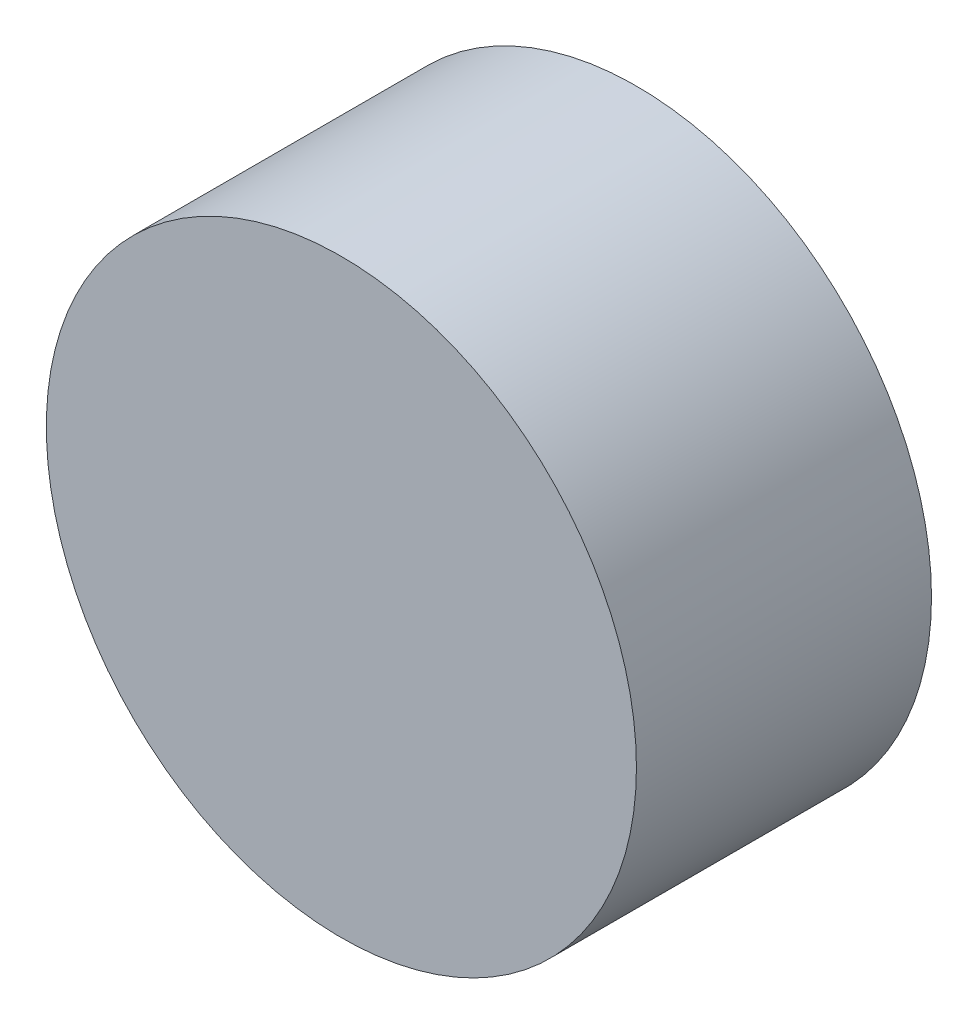
ISO-10303-21;
HEADER;
FILE_DESCRIPTION(('STEP AP214'),'2;1');
FILE_NAME('part.step','',(''),(''),'','','');
FILE_SCHEMA(('AUTOMOTIVE_DESIGN { 1 0 10303 214 1 1 1 1 }'));
ENDSEC;
DATA;
#1=APPLICATION_CONTEXT('core data for automotive mechanical design processes');
#2=APPLICATION_PROTOCOL_DEFINITION('international standard','automotive_design',2000,#1);
#3=PRODUCT_CONTEXT('',#1,'mechanical');
#4=PRODUCT('Part','Part','',(#3));
#5=PRODUCT_RELATED_PRODUCT_CATEGORY('part','',(#4));
#6=PRODUCT_DEFINITION_FORMATION('','',#4);
#7=PRODUCT_DEFINITION_CONTEXT('part definition',#1,'design');
#8=PRODUCT_DEFINITION('design','',#6,#7);
#9=PRODUCT_DEFINITION_SHAPE('','',#8);
#10=(LENGTH_UNIT() NAMED_UNIT(*) SI_UNIT(.MILLI.,.METRE.));
#11=(NAMED_UNIT(*) PLANE_ANGLE_UNIT() SI_UNIT($,.RADIAN.));
#12=(NAMED_UNIT(*) SI_UNIT($,.STERADIAN.) SOLID_ANGLE_UNIT());
#13=UNCERTAINTY_MEASURE_WITH_UNIT(LENGTH_MEASURE(1.E-05),#10,'distance_accuracy_value','');
#14=(GEOMETRIC_REPRESENTATION_CONTEXT(3) GLOBAL_UNCERTAINTY_ASSIGNED_CONTEXT((#13)) GLOBAL_UNIT_ASSIGNED_CONTEXT((#10,
#11,#12)) REPRESENTATION_CONTEXT('',''));
#15=CARTESIAN_POINT('',(0.,0.,0.));
#16=DIRECTION('',(0.,0.,1.));
#17=DIRECTION('',(1.,0.,0.));
#18=AXIS2_PLACEMENT_3D('',#15,#16,#17);
#19=CARTESIAN_POINT('',(0.,0.,6.35));
#20=DIRECTION('',(0.,0.,-1.));
#21=DIRECTION('',(-1.,0.,0.));
#22=AXIS2_PLACEMENT_3D('',#19,#20,#21);
#23=CYLINDRICAL_SURFACE('',#22,6.35);
#24=CARTESIAN_POINT('',(0.,0.,6.35));
#25=DIRECTION('',(0.,0.,1.));
#26=DIRECTION('',(1.,0.,0.));
#27=AXIS2_PLACEMENT_3D('',#24,#25,#26);
#28=CIRCLE('',#27,6.35);
#29=CARTESIAN_POINT('',(6.35,0.,6.35));
#30=VERTEX_POINT('',#29);
#31=EDGE_CURVE('E10',#30,#30,#28,.T.);
#32=ORIENTED_EDGE('',*,*,#31,.F.);
#33=EDGE_LOOP('',(#32));
#34=FACE_BOUND('',#33,.T.);
#35=CARTESIAN_POINT('',(0.,0.,0.));
#36=DIRECTION('',(0.,0.,1.));
#37=DIRECTION('',(1.,0.,0.));
#38=AXIS2_PLACEMENT_3D('',#35,#36,#37);
#39=CIRCLE('',#38,6.35);
#40=CARTESIAN_POINT('',(6.35,0.,0.));
#41=VERTEX_POINT('',#40);
#42=EDGE_CURVE('E35',#41,#41,#39,.T.);
#43=ORIENTED_EDGE('',*,*,#42,.T.);
#44=EDGE_LOOP('',(#43));
#45=FACE_BOUND('',#44,.T.);
#46=ADVANCED_FACE('F32',(#34,#45),#23,.T.);
#47=CARTESIAN_POINT('',(0.,0.,6.35));
#48=DIRECTION('',(0.,0.,1.));
#49=DIRECTION('',(1.,0.,0.));
#50=AXIS2_PLACEMENT_3D('',#47,#48,#49);
#51=PLANE('',#50);
#52=ORIENTED_EDGE('',*,*,#31,.T.);
#53=EDGE_LOOP('',(#52));
#54=FACE_BOUND('',#53,.T.);
#55=ADVANCED_FACE('F47',(#54),#51,.T.);
#56=CARTESIAN_POINT('',(0.,0.,0.));
#57=DIRECTION('',(0.,0.,1.));
#58=DIRECTION('',(1.,0.,0.));
#59=AXIS2_PLACEMENT_3D('',#56,#57,#58);
#60=PLANE('',#59);
#61=ORIENTED_EDGE('',*,*,#42,.F.);
#62=EDGE_LOOP('',(#61));
#63=FACE_BOUND('',#62,.T.);
#64=ADVANCED_FACE('F45',(#63),#60,.F.);
#65=CLOSED_SHELL('',(#46,#55,#64));
#66=MANIFOLD_SOLID_BREP('B2',#65);
#67=ADVANCED_BREP_SHAPE_REPRESENTATION('',(#18,#66),#14);
#68=SHAPE_DEFINITION_REPRESENTATION(#9,#67);
ENDSEC;
END-ISO-10303-21;
